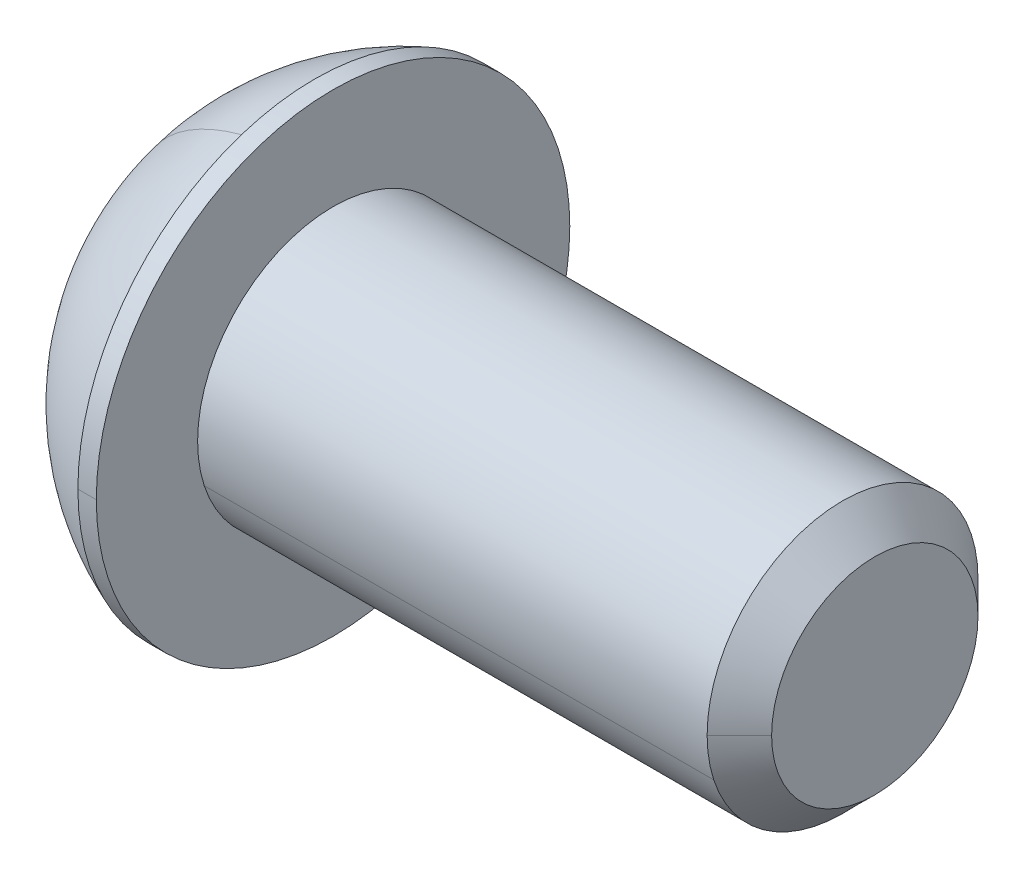
ISO-10303-21;
HEADER;
FILE_DESCRIPTION(('STEP AP214'),'2;1');
FILE_NAME('part.step','',(''),(''),'','','');
FILE_SCHEMA(('AUTOMOTIVE_DESIGN { 1 0 10303 214 1 1 1 1 }'));
ENDSEC;
DATA;
#1=APPLICATION_CONTEXT('core data for automotive mechanical design processes');
#2=APPLICATION_PROTOCOL_DEFINITION('international standard','automotive_design',2000,#1);
#3=PRODUCT_CONTEXT('',#1,'mechanical');
#4=PRODUCT('Part','Part','',(#3));
#5=PRODUCT_RELATED_PRODUCT_CATEGORY('part','',(#4));
#6=PRODUCT_DEFINITION_FORMATION('','',#4);
#7=PRODUCT_DEFINITION_CONTEXT('part definition',#1,'design');
#8=PRODUCT_DEFINITION('design','',#6,#7);
#9=PRODUCT_DEFINITION_SHAPE('','',#8);
#10=(LENGTH_UNIT() NAMED_UNIT(*) SI_UNIT(.MILLI.,.METRE.));
#11=(NAMED_UNIT(*) PLANE_ANGLE_UNIT() SI_UNIT($,.RADIAN.));
#12=(NAMED_UNIT(*) SI_UNIT($,.STERADIAN.) SOLID_ANGLE_UNIT());
#13=UNCERTAINTY_MEASURE_WITH_UNIT(LENGTH_MEASURE(1.E-05),#10,'distance_accuracy_value','');
#14=(GEOMETRIC_REPRESENTATION_CONTEXT(3) GLOBAL_UNCERTAINTY_ASSIGNED_CONTEXT((#13)) GLOBAL_UNIT_ASSIGNED_CONTEXT((#10,
#11,#12)) REPRESENTATION_CONTEXT('',''));
#15=CARTESIAN_POINT('',(0.,0.,0.));
#16=DIRECTION('',(0.,0.,1.));
#17=DIRECTION('',(1.,0.,0.));
#18=AXIS2_PLACEMENT_3D('',#15,#16,#17);
#19=CARTESIAN_POINT('',(-3.3528,0.,0.));
#20=DIRECTION('',(1.,0.,0.));
#21=DIRECTION('',(0.,0.,-1.));
#22=AXIS2_PLACEMENT_3D('',#19,#20,#21);
#23=PLANE('',#22);
#24=CARTESIAN_POINT('',(-3.3528,0.,0.));
#25=DIRECTION('',(1.,0.,0.));
#26=DIRECTION('',(0.,0.,-1.));
#27=AXIS2_PLACEMENT_3D('',#24,#25,#26);
#28=CIRCLE('',#27,3.175);
#29=CARTESIAN_POINT('',(-3.35280000000001,3.01960443923711,0.981128957140456));
#30=VERTEX_POINT('',#29);
#31=CARTESIAN_POINT('',(-3.35280000000001,-3.0196044392371,-0.981128957140455));
#32=VERTEX_POINT('',#31);
#33=EDGE_CURVE('E11',#30,#32,#28,.T.);
#34=ORIENTED_EDGE('',*,*,#33,.F.);
#35=CARTESIAN_POINT('',(-3.3528,0.,0.));
#36=DIRECTION('',(1.,0.,0.));
#37=DIRECTION('',(0.,-0.951056516295154,-0.309016994374947));
#38=AXIS2_PLACEMENT_3D('',#35,#36,#37);
#39=CIRCLE('',#38,3.175);
#40=EDGE_CURVE('E24',#32,#30,#39,.T.);
#41=ORIENTED_EDGE('',*,*,#40,.F.);
#42=EDGE_LOOP('',(#34,#41));
#43=FACE_BOUND('',#42,.T.);
#44=DIRECTION('',(0.,0.866025403784451,-0.499999999999979));
#45=VECTOR('',#44,1.);
#46=CARTESIAN_POINT('',(-3.3528,0.992187499999961,1.71851916063477));
#47=LINE('',#46,#45);
#48=CARTESIAN_POINT('',(-3.3528,0.,2.2913588808463));
#49=VERTEX_POINT('',#48);
#50=CARTESIAN_POINT('',(-3.3528,1.984375,1.1456794404232));
#51=VERTEX_POINT('',#50);
#52=EDGE_CURVE('E299',#49,#51,#47,.T.);
#53=ORIENTED_EDGE('',*,*,#52,.F.);
#54=DIRECTION('',(0.,0.866025403784451,0.499999999999979));
#55=VECTOR('',#54,1.);
#56=CARTESIAN_POINT('',(-3.3528,-0.992187499999961,1.71851916063477));
#57=LINE('',#56,#55);
#58=CARTESIAN_POINT('',(-3.3528,-1.984375,1.1456794404232));
#59=VERTEX_POINT('',#58);
#60=EDGE_CURVE('E294',#59,#49,#57,.T.);
#61=ORIENTED_EDGE('',*,*,#60,.F.);
#62=DIRECTION('',(0.,0.,1.));
#63=VECTOR('',#62,1.);
#64=CARTESIAN_POINT('',(-3.3528,-1.984375,0.));
#65=LINE('',#64,#63);
#66=CARTESIAN_POINT('',(-3.3528,-1.984375,-1.1456794404232));
#67=VERTEX_POINT('',#66);
#68=EDGE_CURVE('E289',#67,#59,#65,.T.);
#69=ORIENTED_EDGE('',*,*,#68,.F.);
#70=DIRECTION('',(0.,-0.866025403784451,0.499999999999979));
#71=VECTOR('',#70,1.);
#72=CARTESIAN_POINT('',(-3.3528,-0.992187499999961,-1.71851916063477));
#73=LINE('',#72,#71);
#74=CARTESIAN_POINT('',(-3.3528,0.,-2.2913588808463));
#75=VERTEX_POINT('',#74);
#76=EDGE_CURVE('E284',#75,#67,#73,.T.);
#77=ORIENTED_EDGE('',*,*,#76,.F.);
#78=DIRECTION('',(0.,-0.866025403784451,-0.499999999999979));
#79=VECTOR('',#78,1.);
#80=CARTESIAN_POINT('',(-3.3528,0.992187499999961,-1.71851916063477));
#81=LINE('',#80,#79);
#82=CARTESIAN_POINT('',(-3.3528,1.984375,-1.1456794404232));
#83=VERTEX_POINT('',#82);
#84=EDGE_CURVE('E279',#83,#75,#81,.T.);
#85=ORIENTED_EDGE('',*,*,#84,.F.);
#86=DIRECTION('',(0.,0.,-1.));
#87=VECTOR('',#86,1.);
#88=CARTESIAN_POINT('',(-3.3528,1.984375,0.));
#89=LINE('',#88,#87);
#90=EDGE_CURVE('E274',#51,#83,#89,.T.);
#91=ORIENTED_EDGE('',*,*,#90,.F.);
#92=EDGE_LOOP('',(#53,#61,#69,#77,#85,#91));
#93=FACE_BOUND('',#92,.T.);
#94=ADVANCED_FACE('F16',(#43,#93),#23,.F.);
#95=CARTESIAN_POINT('',(-1.1303,1.984375,-1.1456794404232));
#96=DIRECTION('',(0.,-1.,0.));
#97=DIRECTION('',(0.,0.,-1.));
#98=AXIS2_PLACEMENT_3D('',#95,#96,#97);
#99=PLANE('',#98);
#100=DIRECTION('',(-1.,0.,0.));
#101=VECTOR('',#100,1.);
#102=CARTESIAN_POINT('',(-1.1303,1.984375,1.1456794404232));
#103=LINE('',#102,#101);
#104=CARTESIAN_POINT('',(-1.1303,1.984375,1.1456794404232));
#105=VERTEX_POINT('',#104);
#106=EDGE_CURVE('E269',#105,#51,#103,.T.);
#107=ORIENTED_EDGE('',*,*,#106,.T.);
#108=ORIENTED_EDGE('',*,*,#90,.T.);
#109=DIRECTION('',(-1.,0.,0.));
#110=VECTOR('',#109,1.);
#111=CARTESIAN_POINT('',(-1.1303,1.984375,-1.1456794404232));
#112=LINE('',#111,#110);
#113=CARTESIAN_POINT('',(-1.1303,1.984375,-1.1456794404232));
#114=VERTEX_POINT('',#113);
#115=EDGE_CURVE('E264',#114,#83,#112,.T.);
#116=ORIENTED_EDGE('',*,*,#115,.F.);
#117=DIRECTION('',(0.,0.,1.));
#118=VECTOR('',#117,1.);
#119=CARTESIAN_POINT('',(-1.1303,1.984375,-1.1456794404232));
#120=LINE('',#119,#118);
#121=EDGE_CURVE('E260',#114,#105,#120,.T.);
#122=ORIENTED_EDGE('',*,*,#121,.T.);
#123=EDGE_LOOP('',(#107,#108,#116,#122));
#124=FACE_BOUND('',#123,.T.);
#125=ADVANCED_FACE('F334',(#124),#99,.T.);
#126=CARTESIAN_POINT('',(-1.1303,0.,0.));
#127=DIRECTION('',(1.,0.,0.));
#128=DIRECTION('',(0.,0.,-1.));
#129=AXIS2_PLACEMENT_3D('',#126,#127,#128);
#130=PLANE('',#129);
#131=DIRECTION('',(0.,-0.866025403784451,0.499999999999979));
#132=VECTOR('',#131,1.);
#133=CARTESIAN_POINT('',(-1.1303,1.984375,1.1456794404232));
#134=LINE('',#133,#132);
#135=CARTESIAN_POINT('',(-1.1303,0.,2.2913588808463));
#136=VERTEX_POINT('',#135);
#137=EDGE_CURVE('E255',#105,#136,#134,.T.);
#138=ORIENTED_EDGE('',*,*,#137,.F.);
#139=ORIENTED_EDGE('',*,*,#121,.F.);
#140=DIRECTION('',(0.,0.866025403784451,0.499999999999979));
#141=VECTOR('',#140,1.);
#142=CARTESIAN_POINT('',(-1.1303,0.,-2.2913588808463));
#143=LINE('',#142,#141);
#144=CARTESIAN_POINT('',(-1.1303,0.,-2.2913588808463));
#145=VERTEX_POINT('',#144);
#146=EDGE_CURVE('E250',#145,#114,#143,.T.);
#147=ORIENTED_EDGE('',*,*,#146,.F.);
#148=DIRECTION('',(0.,0.866025403784451,-0.499999999999979));
#149=VECTOR('',#148,1.);
#150=CARTESIAN_POINT('',(-1.1303,-1.984375,-1.1456794404232));
#151=LINE('',#150,#149);
#152=CARTESIAN_POINT('',(-1.1303,-1.984375,-1.1456794404232));
#153=VERTEX_POINT('',#152);
#154=EDGE_CURVE('E245',#153,#145,#151,.T.);
#155=ORIENTED_EDGE('',*,*,#154,.F.);
#156=DIRECTION('',(0.,0.,-1.));
#157=VECTOR('',#156,1.);
#158=CARTESIAN_POINT('',(-1.1303,-1.984375,1.1456794404232));
#159=LINE('',#158,#157);
#160=CARTESIAN_POINT('',(-1.1303,-1.984375,1.1456794404232));
#161=VERTEX_POINT('',#160);
#162=EDGE_CURVE('E240',#161,#153,#159,.T.);
#163=ORIENTED_EDGE('',*,*,#162,.F.);
#164=DIRECTION('',(0.,-0.866025403784451,-0.499999999999979));
#165=VECTOR('',#164,1.);
#166=CARTESIAN_POINT('',(-1.1303,0.,2.2913588808463));
#167=LINE('',#166,#165);
#168=EDGE_CURVE('E235',#136,#161,#167,.T.);
#169=ORIENTED_EDGE('',*,*,#168,.F.);
#170=EDGE_LOOP('',(#138,#139,#147,#155,#163,#169));
#171=FACE_BOUND('',#170,.T.);
#172=ADVANCED_FACE('F338',(#171),#130,.F.);
#173=CARTESIAN_POINT('',(-1.1303,0.,2.2913588808463));
#174=DIRECTION('',(0.,0.499999999999979,-0.866025403784451));
#175=DIRECTION('',(0.,0.866025403784451,0.499999999999979));
#176=AXIS2_PLACEMENT_3D('',#173,#174,#175);
#177=PLANE('',#176);
#178=ORIENTED_EDGE('',*,*,#60,.T.);
#179=DIRECTION('',(-1.,0.,0.));
#180=VECTOR('',#179,1.);
#181=CARTESIAN_POINT('',(-1.1303,0.,2.2913588808463));
#182=LINE('',#181,#180);
#183=EDGE_CURVE('E230',#136,#49,#182,.T.);
#184=ORIENTED_EDGE('',*,*,#183,.F.);
#185=ORIENTED_EDGE('',*,*,#168,.T.);
#186=DIRECTION('',(-1.,0.,0.));
#187=VECTOR('',#186,1.);
#188=CARTESIAN_POINT('',(-1.1303,-1.984375,1.1456794404232));
#189=LINE('',#188,#187);
#190=EDGE_CURVE('E225',#161,#59,#189,.T.);
#191=ORIENTED_EDGE('',*,*,#190,.T.);
#192=EDGE_LOOP('',(#178,#184,#185,#191));
#193=FACE_BOUND('',#192,.T.);
#194=ADVANCED_FACE('F347',(#193),#177,.T.);
#195=CARTESIAN_POINT('',(-1.1303,-1.984375,1.1456794404232));
#196=DIRECTION('',(0.,1.,0.));
#197=DIRECTION('',(0.,0.,1.));
#198=AXIS2_PLACEMENT_3D('',#195,#196,#197);
#199=PLANE('',#198);
#200=ORIENTED_EDGE('',*,*,#68,.T.);
#201=ORIENTED_EDGE('',*,*,#190,.F.);
#202=ORIENTED_EDGE('',*,*,#162,.T.);
#203=DIRECTION('',(-1.,0.,0.));
#204=VECTOR('',#203,1.);
#205=CARTESIAN_POINT('',(-1.1303,-1.984375,-1.1456794404232));
#206=LINE('',#205,#204);
#207=EDGE_CURVE('E220',#153,#67,#206,.T.);
#208=ORIENTED_EDGE('',*,*,#207,.T.);
#209=EDGE_LOOP('',(#200,#201,#202,#208));
#210=FACE_BOUND('',#209,.T.);
#211=ADVANCED_FACE('F350',(#210),#199,.T.);
#212=CARTESIAN_POINT('',(-1.1303,-1.984375,-1.1456794404232));
#213=DIRECTION('',(0.,0.499999999999979,0.866025403784451));
#214=DIRECTION('',(0.,-0.866025403784451,0.499999999999979));
#215=AXIS2_PLACEMENT_3D('',#212,#213,#214);
#216=PLANE('',#215);
#217=ORIENTED_EDGE('',*,*,#76,.T.);
#218=ORIENTED_EDGE('',*,*,#207,.F.);
#219=ORIENTED_EDGE('',*,*,#154,.T.);
#220=DIRECTION('',(-1.,0.,0.));
#221=VECTOR('',#220,1.);
#222=CARTESIAN_POINT('',(-1.1303,0.,-2.2913588808463));
#223=LINE('',#222,#221);
#224=EDGE_CURVE('E215',#145,#75,#223,.T.);
#225=ORIENTED_EDGE('',*,*,#224,.T.);
#226=EDGE_LOOP('',(#217,#218,#219,#225));
#227=FACE_BOUND('',#226,.T.);
#228=ADVANCED_FACE('F354',(#227),#216,.T.);
#229=CARTESIAN_POINT('',(-1.1303,0.,-2.2913588808463));
#230=DIRECTION('',(0.,-0.499999999999979,0.866025403784451));
#231=DIRECTION('',(0.,-0.866025403784451,-0.499999999999979));
#232=AXIS2_PLACEMENT_3D('',#229,#230,#231);
#233=PLANE('',#232);
#234=ORIENTED_EDGE('',*,*,#84,.T.);
#235=ORIENTED_EDGE('',*,*,#224,.F.);
#236=ORIENTED_EDGE('',*,*,#146,.T.);
#237=ORIENTED_EDGE('',*,*,#115,.T.);
#238=EDGE_LOOP('',(#234,#235,#236,#237));
#239=FACE_BOUND('',#238,.T.);
#240=ADVANCED_FACE('F356',(#239),#233,.T.);
#241=CARTESIAN_POINT('',(-1.1303,1.984375,1.1456794404232));
#242=DIRECTION('',(0.,-0.499999999999979,-0.866025403784451));
#243=DIRECTION('',(0.,0.866025403784451,-0.499999999999979));
#244=AXIS2_PLACEMENT_3D('',#241,#242,#243);
#245=PLANE('',#244);
#246=ORIENTED_EDGE('',*,*,#52,.T.);
#247=ORIENTED_EDGE('',*,*,#106,.F.);
#248=ORIENTED_EDGE('',*,*,#137,.T.);
#249=ORIENTED_EDGE('',*,*,#183,.T.);
#250=EDGE_LOOP('',(#246,#247,#248,#249));
#251=FACE_BOUND('',#250,.T.);
#252=ADVANCED_FACE('F344',(#251),#245,.T.);
#253=CARTESIAN_POINT('',(1.64730562793125,0.,0.));
#254=DIRECTION('',(1.,0.,0.));
#255=DIRECTION('',(0.,-0.309016994374947,0.951056516295154));
#256=AXIS2_PLACEMENT_3D('',#253,#254,#255);
#257=DEGENERATE_TOROIDAL_SURFACE('',#256,0.00892436136798675,5.91820000000075,.T.);
#258=CARTESIAN_POINT('',(1.64730562793125,-0.00848757203279653,-0.00275777932665116));
#259=DIRECTION('',(0.,0.309016994374947,-0.951056516295154));
#260=DIRECTION('',(-0.351307091333682,-0.890436448202664,-0.289320340264718));
#261=AXIS2_PLACEMENT_3D('',#258,#259,#260);
#262=CIRCLE('',#261,5.91820000000075);
#263=CARTESIAN_POINT('',(-0.431800000000015,-5.27826855978647,-1.71501341708152));
#264=VERTEX_POINT('',#263);
#265=EDGE_CURVE('E211',#264,#32,#262,.T.);
#266=ORIENTED_EDGE('',*,*,#265,.T.);
#267=ORIENTED_EDGE('',*,*,#40,.T.);
#268=CARTESIAN_POINT('',(1.64730562793125,0.00848757203279653,0.00275777932665116));
#269=DIRECTION('',(0.,-0.309016994374947,0.951056516295154));
#270=DIRECTION('',(-0.351307091333681,0.890436448202665,0.289320340264718));
#271=AXIS2_PLACEMENT_3D('',#268,#269,#270);
#272=CIRCLE('',#271,5.91820000000075);
#273=CARTESIAN_POINT('',(-0.43180000000001,5.27826855978647,1.71501341708152));
#274=VERTEX_POINT('',#273);
#275=EDGE_CURVE('E207',#274,#30,#272,.T.);
#276=ORIENTED_EDGE('',*,*,#275,.F.);
#277=CARTESIAN_POINT('',(-0.4318,0.,0.));
#278=DIRECTION('',(1.,0.,0.));
#279=DIRECTION('',(0.,0.,-1.));
#280=AXIS2_PLACEMENT_3D('',#277,#278,#279);
#281=CIRCLE('',#280,5.5499);
#282=CARTESIAN_POINT('',(-0.4318,0.,-5.5499));
#283=VERTEX_POINT('',#282);
#284=EDGE_CURVE('E202',#283,#274,#281,.T.);
#285=ORIENTED_EDGE('',*,*,#284,.F.);
#286=CARTESIAN_POINT('',(-0.4318,0.,0.));
#287=DIRECTION('',(1.,0.,0.));
#288=DIRECTION('',(0.,0.,-1.));
#289=AXIS2_PLACEMENT_3D('',#286,#287,#288);
#290=CIRCLE('',#289,5.5499);
#291=EDGE_CURVE('E197',#264,#283,#290,.T.);
#292=ORIENTED_EDGE('',*,*,#291,.F.);
#293=EDGE_LOOP('',(#266,#267,#276,#285,#292));
#294=FACE_BOUND('',#293,.T.);
#295=ADVANCED_FACE('F309',(#294),#257,.T.);
#296=CARTESIAN_POINT('',(12.7,0.,0.));
#297=DIRECTION('',(1.,0.,0.));
#298=DIRECTION('',(0.,1.,0.));
#299=AXIS2_PLACEMENT_3D('',#296,#297,#298);
#300=CYLINDRICAL_SURFACE('',#299,5.5499);
#301=DIRECTION('',(1.,0.,0.));
#302=VECTOR('',#301,1.);
#303=CARTESIAN_POINT('',(-0.431799999999999,0.,5.5499));
#304=LINE('',#303,#302);
#305=CARTESIAN_POINT('',(-0.431799999999999,0.,5.5499));
#306=VERTEX_POINT('',#305);
#307=CARTESIAN_POINT('',(0.,0.,5.5499));
#308=VERTEX_POINT('',#307);
#309=EDGE_CURVE('E192',#306,#308,#304,.T.);
#310=ORIENTED_EDGE('',*,*,#309,.F.);
#311=CARTESIAN_POINT('',(-0.4318,0.,0.));
#312=DIRECTION('',(1.,0.,0.));
#313=DIRECTION('',(0.,0.,-1.));
#314=AXIS2_PLACEMENT_3D('',#311,#312,#313);
#315=CIRCLE('',#314,5.5499);
#316=EDGE_CURVE('E187',#306,#264,#315,.T.);
#317=ORIENTED_EDGE('',*,*,#316,.T.);
#318=ORIENTED_EDGE('',*,*,#291,.T.);
#319=DIRECTION('',(1.,0.,0.));
#320=VECTOR('',#319,1.);
#321=CARTESIAN_POINT('',(-0.431799999999999,0.,-5.5499));
#322=LINE('',#321,#320);
#323=CARTESIAN_POINT('',(0.,0.,-5.5499));
#324=VERTEX_POINT('',#323);
#325=EDGE_CURVE('E183',#283,#324,#322,.T.);
#326=ORIENTED_EDGE('',*,*,#325,.T.);
#327=CARTESIAN_POINT('',(0.,0.,0.));
#328=DIRECTION('',(1.,0.,0.));
#329=DIRECTION('',(0.,0.,-1.));
#330=AXIS2_PLACEMENT_3D('',#327,#328,#329);
#331=CIRCLE('',#330,5.5499);
#332=EDGE_CURVE('E178',#308,#324,#331,.T.);
#333=ORIENTED_EDGE('',*,*,#332,.F.);
#334=EDGE_LOOP('',(#310,#317,#318,#326,#333));
#335=FACE_BOUND('',#334,.T.);
#336=ADVANCED_FACE('F320',(#335),#300,.T.);
#337=CARTESIAN_POINT('',(0.,5.5499,0.));
#338=DIRECTION('',(-1.,0.,0.));
#339=DIRECTION('',(0.,0.,1.));
#340=AXIS2_PLACEMENT_3D('',#337,#338,#339);
#341=PLANE('',#340);
#342=CARTESIAN_POINT('',(0.,0.,0.));
#343=DIRECTION('',(1.,0.,0.));
#344=DIRECTION('',(0.,0.,-1.));
#345=AXIS2_PLACEMENT_3D('',#342,#343,#344);
#346=CIRCLE('',#345,3.175);
#347=CARTESIAN_POINT('',(0.,-0.981128957140458,3.01960443923711));
#348=VERTEX_POINT('',#347);
#349=CARTESIAN_POINT('',(0.,0.,-3.175));
#350=VERTEX_POINT('',#349);
#351=EDGE_CURVE('E173',#348,#350,#346,.T.);
#352=ORIENTED_EDGE('',*,*,#351,.F.);
#353=CARTESIAN_POINT('',(0.,0.,0.));
#354=DIRECTION('',(1.,0.,0.));
#355=DIRECTION('',(0.,0.,-1.));
#356=AXIS2_PLACEMENT_3D('',#353,#354,#355);
#357=CIRCLE('',#356,3.175);
#358=EDGE_CURVE('E168',#350,#348,#357,.T.);
#359=ORIENTED_EDGE('',*,*,#358,.F.);
#360=EDGE_LOOP('',(#352,#359));
#361=FACE_BOUND('',#360,.T.);
#362=CARTESIAN_POINT('',(0.,0.,0.));
#363=DIRECTION('',(1.,0.,0.));
#364=DIRECTION('',(0.,0.,-1.));
#365=AXIS2_PLACEMENT_3D('',#362,#363,#364);
#366=CIRCLE('',#365,5.5499);
#367=EDGE_CURVE('E163',#324,#308,#366,.T.);
#368=ORIENTED_EDGE('',*,*,#367,.T.);
#369=ORIENTED_EDGE('',*,*,#332,.T.);
#370=EDGE_LOOP('',(#368,#369));
#371=FACE_BOUND('',#370,.T.);
#372=ADVANCED_FACE('F322',(#361,#371),#341,.F.);
#373=CARTESIAN_POINT('',(12.7,0.,0.));
#374=DIRECTION('',(1.,0.,0.));
#375=DIRECTION('',(0.,-1.,0.));
#376=AXIS2_PLACEMENT_3D('',#373,#374,#375);
#377=CYLINDRICAL_SURFACE('',#376,5.5499);
#378=ORIENTED_EDGE('',*,*,#309,.T.);
#379=ORIENTED_EDGE('',*,*,#367,.F.);
#380=ORIENTED_EDGE('',*,*,#325,.F.);
#381=ORIENTED_EDGE('',*,*,#284,.T.);
#382=CARTESIAN_POINT('',(-0.4318,0.,0.));
#383=DIRECTION('',(1.,0.,0.));
#384=DIRECTION('',(0.,0.,-1.));
#385=AXIS2_PLACEMENT_3D('',#382,#383,#384);
#386=CIRCLE('',#385,5.5499);
#387=EDGE_CURVE('E158',#274,#306,#386,.T.);
#388=ORIENTED_EDGE('',*,*,#387,.T.);
#389=EDGE_LOOP('',(#378,#379,#380,#381,#388));
#390=FACE_BOUND('',#389,.T.);
#391=ADVANCED_FACE('F317',(#390),#377,.T.);
#392=CARTESIAN_POINT('',(1.64730562793125,0.,0.));
#393=DIRECTION('',(1.,0.,0.));
#394=DIRECTION('',(0.,0.309016994374947,-0.951056516295154));
#395=AXIS2_PLACEMENT_3D('',#392,#393,#394);
#396=DEGENERATE_TOROIDAL_SURFACE('',#395,0.00892436136798675,5.91820000000075,.T.);
#397=ORIENTED_EDGE('',*,*,#265,.F.);
#398=ORIENTED_EDGE('',*,*,#316,.F.);
#399=ORIENTED_EDGE('',*,*,#387,.F.);
#400=ORIENTED_EDGE('',*,*,#275,.T.);
#401=ORIENTED_EDGE('',*,*,#33,.T.);
#402=EDGE_LOOP('',(#397,#398,#399,#400,#401));
#403=FACE_BOUND('',#402,.T.);
#404=ADVANCED_FACE('F314',(#403),#396,.T.);
#405=CARTESIAN_POINT('',(12.7,0.,0.));
#406=DIRECTION('',(1.,0.,0.));
#407=DIRECTION('',(0.,-0.987688340595138,-0.156434465040231));
#408=AXIS2_PLACEMENT_3D('',#405,#406,#407);
#409=CYLINDRICAL_SURFACE('',#408,3.175);
#410=DIRECTION('',(1.,0.,0.));
#411=VECTOR('',#410,1.);
#412=CARTESIAN_POINT('',(0.,-0.981128957140458,3.01960443923711));
#413=LINE('',#412,#411);
#414=CARTESIAN_POINT('',(11.94435,-0.981128957140458,3.01960443923711));
#415=VERTEX_POINT('',#414);
#416=EDGE_CURVE('E154',#348,#415,#413,.T.);
#417=ORIENTED_EDGE('',*,*,#416,.T.);
#418=CARTESIAN_POINT('',(11.94435,0.,0.));
#419=DIRECTION('',(1.,0.,0.));
#420=DIRECTION('',(0.,0.,-1.));
#421=AXIS2_PLACEMENT_3D('',#418,#419,#420);
#422=CIRCLE('',#421,3.175);
#423=CARTESIAN_POINT('',(11.94435,0.,3.175));
#424=VERTEX_POINT('',#423);
#425=EDGE_CURVE('E150',#424,#415,#422,.T.);
#426=ORIENTED_EDGE('',*,*,#425,.F.);
#427=CARTESIAN_POINT('',(11.94435,0.,0.));
#428=DIRECTION('',(1.,0.,0.));
#429=DIRECTION('',(0.,0.,-1.));
#430=AXIS2_PLACEMENT_3D('',#427,#428,#429);
#431=CIRCLE('',#430,3.175);
#432=CARTESIAN_POINT('',(11.94435,0.,-3.175));
#433=VERTEX_POINT('',#432);
#434=EDGE_CURVE('E128',#433,#424,#431,.T.);
#435=ORIENTED_EDGE('',*,*,#434,.F.);
#436=DIRECTION('',(1.,0.,0.));
#437=VECTOR('',#436,1.);
#438=CARTESIAN_POINT('',(0.,0.,-3.175));
#439=LINE('',#438,#437);
#440=EDGE_CURVE('E142',#350,#433,#439,.T.);
#441=ORIENTED_EDGE('',*,*,#440,.F.);
#442=ORIENTED_EDGE('',*,*,#358,.T.);
#443=EDGE_LOOP('',(#417,#426,#435,#441,#442));
#444=FACE_BOUND('',#443,.T.);
#445=ADVANCED_FACE('F411',(#444),#409,.T.);
#446=CARTESIAN_POINT('',(12.7,0.,0.));
#447=DIRECTION('',(1.,0.,0.));
#448=DIRECTION('',(0.,0.987688340595138,0.156434465040231));
#449=AXIS2_PLACEMENT_3D('',#446,#447,#448);
#450=CYLINDRICAL_SURFACE('',#449,3.175);
#451=ORIENTED_EDGE('',*,*,#416,.F.);
#452=ORIENTED_EDGE('',*,*,#351,.T.);
#453=ORIENTED_EDGE('',*,*,#440,.T.);
#454=CARTESIAN_POINT('',(11.94435,0.,0.));
#455=DIRECTION('',(1.,0.,0.));
#456=DIRECTION('',(0.,0.,-1.));
#457=AXIS2_PLACEMENT_3D('',#454,#455,#456);
#458=CIRCLE('',#457,3.175);
#459=EDGE_CURVE('E138',#415,#433,#458,.T.);
#460=ORIENTED_EDGE('',*,*,#459,.F.);
#461=EDGE_LOOP('',(#451,#452,#453,#460));
#462=FACE_BOUND('',#461,.T.);
#463=ADVANCED_FACE('F421',(#462),#450,.T.);
#464=CARTESIAN_POINT('',(11.94435,0.,0.));
#465=DIRECTION('',(-1.,0.,0.));
#466=DIRECTION('',(0.,1.,0.));
#467=AXIS2_PLACEMENT_3D('',#464,#465,#466);
#468=CONICAL_SURFACE('',#467,3.175,0.785398163397448);
#469=DIRECTION('',(-0.707106781186548,0.,-0.707106781186548));
#470=VECTOR('',#469,1.);
#471=CARTESIAN_POINT('',(12.7,0.,-2.41935));
#472=LINE('',#471,#470);
#473=CARTESIAN_POINT('',(12.7,0.,-2.41935));
#474=VERTEX_POINT('',#473);
#475=EDGE_CURVE('E119',#474,#433,#472,.T.);
#476=ORIENTED_EDGE('',*,*,#475,.F.);
#477=CARTESIAN_POINT('',(12.7,0.,0.));
#478=DIRECTION('',(1.,0.,0.));
#479=DIRECTION('',(0.,0.,-1.));
#480=AXIS2_PLACEMENT_3D('',#477,#478,#479);
#481=CIRCLE('',#480,2.41935);
#482=CARTESIAN_POINT('',(12.7,0.,2.41935));
#483=VERTEX_POINT('',#482);
#484=EDGE_CURVE('E110',#483,#474,#481,.T.);
#485=ORIENTED_EDGE('',*,*,#484,.F.);
#486=DIRECTION('',(-0.707106781186548,0.,0.707106781186548));
#487=VECTOR('',#486,1.);
#488=CARTESIAN_POINT('',(12.7,0.,2.41935));
#489=LINE('',#488,#487);
#490=EDGE_CURVE('E115',#483,#424,#489,.T.);
#491=ORIENTED_EDGE('',*,*,#490,.T.);
#492=ORIENTED_EDGE('',*,*,#425,.T.);
#493=ORIENTED_EDGE('',*,*,#459,.T.);
#494=EDGE_LOOP('',(#476,#485,#491,#492,#493));
#495=FACE_BOUND('',#494,.T.);
#496=ADVANCED_FACE('F112',(#495),#468,.T.);
#497=CARTESIAN_POINT('',(11.94435,0.,0.));
#498=DIRECTION('',(-1.,0.,0.));
#499=DIRECTION('',(0.,-1.,0.));
#500=AXIS2_PLACEMENT_3D('',#497,#498,#499);
#501=CONICAL_SURFACE('',#500,3.175,0.785398163397448);
#502=ORIENTED_EDGE('',*,*,#475,.T.);
#503=ORIENTED_EDGE('',*,*,#434,.T.);
#504=ORIENTED_EDGE('',*,*,#490,.F.);
#505=CARTESIAN_POINT('',(12.7,0.,0.));
#506=DIRECTION('',(1.,0.,0.));
#507=DIRECTION('',(0.,0.,-1.));
#508=AXIS2_PLACEMENT_3D('',#505,#506,#507);
#509=CIRCLE('',#508,2.41935);
#510=EDGE_CURVE('E123',#474,#483,#509,.T.);
#511=ORIENTED_EDGE('',*,*,#510,.F.);
#512=EDGE_LOOP('',(#502,#503,#504,#511));
#513=FACE_BOUND('',#512,.T.);
#514=ADVANCED_FACE('F127',(#513),#501,.T.);
#515=CARTESIAN_POINT('',(12.7,2.41935,0.));
#516=DIRECTION('',(-1.,0.,0.));
#517=DIRECTION('',(0.,0.,1.));
#518=AXIS2_PLACEMENT_3D('',#515,#516,#517);
#519=PLANE('',#518);
#520=ORIENTED_EDGE('',*,*,#510,.T.);
#521=ORIENTED_EDGE('',*,*,#484,.T.);
#522=EDGE_LOOP('',(#520,#521));
#523=FACE_BOUND('',#522,.T.);
#524=ADVANCED_FACE('F124',(#523),#519,.F.);
#525=CLOSED_SHELL('',(#94,#125,#172,#194,#211,#228,#240,#252,#295,#336,#372,#391,#404,#445,#463,
#496,#514,#524));
#526=MANIFOLD_SOLID_BREP('B1',#525);
#527=ADVANCED_BREP_SHAPE_REPRESENTATION('',(#18,#526),#14);
#528=SHAPE_DEFINITION_REPRESENTATION(#9,#527);
ENDSEC;
END-ISO-10303-21;
